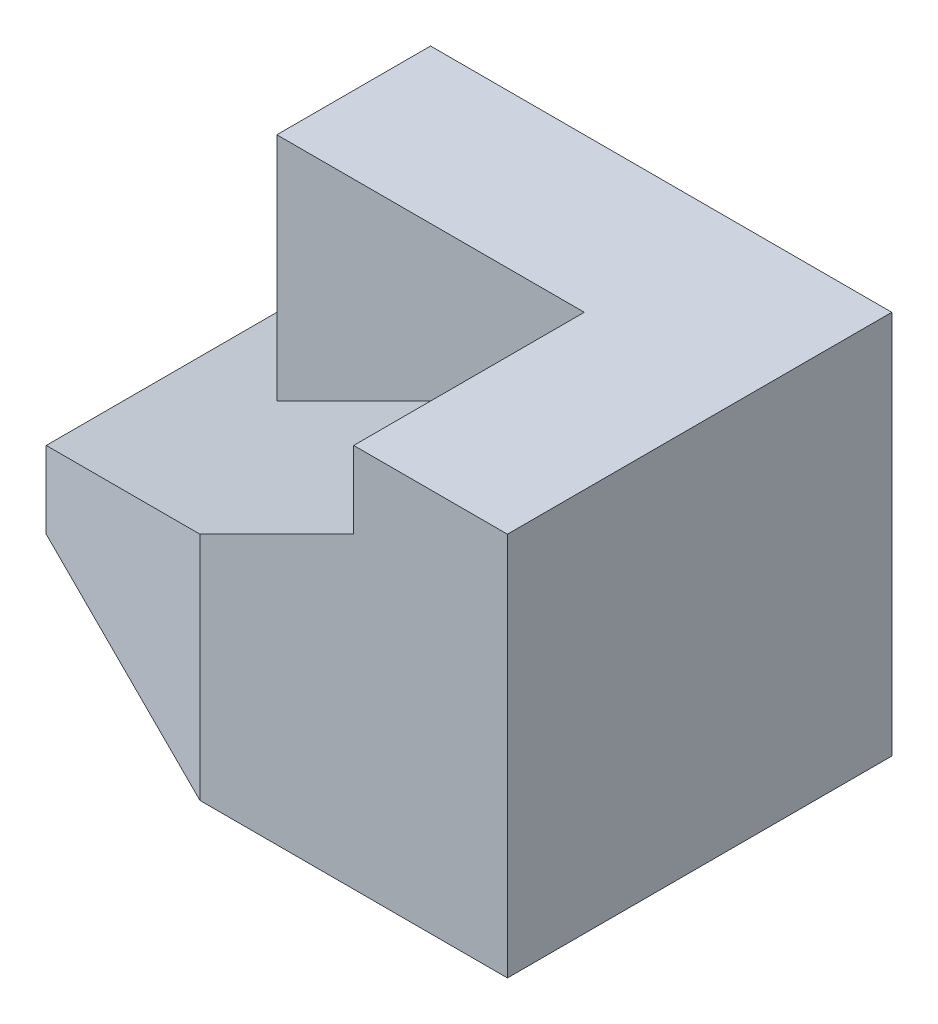
ISO-10303-21;
HEADER;
FILE_DESCRIPTION(('STEP AP214'),'2;1');
FILE_NAME('part.step','',(''),(''),'','','');
FILE_SCHEMA(('AUTOMOTIVE_DESIGN { 1 0 10303 214 1 1 1 1 }'));
ENDSEC;
DATA;
#1=APPLICATION_CONTEXT('core data for automotive mechanical design processes');
#2=APPLICATION_PROTOCOL_DEFINITION('international standard','automotive_design',2000,#1);
#3=PRODUCT_CONTEXT('',#1,'mechanical');
#4=PRODUCT('Part','Part','',(#3));
#5=PRODUCT_RELATED_PRODUCT_CATEGORY('part','',(#4));
#6=PRODUCT_DEFINITION_FORMATION('','',#4);
#7=PRODUCT_DEFINITION_CONTEXT('part definition',#1,'design');
#8=PRODUCT_DEFINITION('design','',#6,#7);
#9=PRODUCT_DEFINITION_SHAPE('','',#8);
#10=(LENGTH_UNIT() NAMED_UNIT(*) SI_UNIT(.MILLI.,.METRE.));
#11=(NAMED_UNIT(*) PLANE_ANGLE_UNIT() SI_UNIT($,.RADIAN.));
#12=(NAMED_UNIT(*) SI_UNIT($,.STERADIAN.) SOLID_ANGLE_UNIT());
#13=UNCERTAINTY_MEASURE_WITH_UNIT(LENGTH_MEASURE(1.E-05),#10,'distance_accuracy_value','');
#14=(GEOMETRIC_REPRESENTATION_CONTEXT(3) GLOBAL_UNCERTAINTY_ASSIGNED_CONTEXT((#13)) GLOBAL_UNIT_ASSIGNED_CONTEXT((#10,
#11,#12)) REPRESENTATION_CONTEXT('',''));
#15=CARTESIAN_POINT('',(0.,0.,0.));
#16=DIRECTION('',(0.,0.,1.));
#17=DIRECTION('',(1.,0.,0.));
#18=AXIS2_PLACEMENT_3D('',#15,#16,#17);
#19=CARTESIAN_POINT('',(0.,0.,-50.));
#20=DIRECTION('',(0.,0.,-1.));
#21=DIRECTION('',(-1.,0.,0.));
#22=AXIS2_PLACEMENT_3D('',#19,#20,#21);
#23=PLANE('',#22);
#24=DIRECTION('',(0.,1.,0.));
#25=VECTOR('',#24,1.);
#26=CARTESIAN_POINT('',(80.,0.,-50.));
#27=LINE('',#26,#25);
#28=CARTESIAN_POINT('',(80.,0.,-50.));
#29=VERTEX_POINT('',#28);
#30=CARTESIAN_POINT('',(80.,50.,-50.));
#31=VERTEX_POINT('',#30);
#32=EDGE_CURVE('E162',#29,#31,#27,.T.);
#33=ORIENTED_EDGE('',*,*,#32,.F.);
#34=DIRECTION('',(1.,0.,0.));
#35=VECTOR('',#34,1.);
#36=CARTESIAN_POINT('',(0.,0.,-50.));
#37=LINE('',#36,#35);
#38=CARTESIAN_POINT('',(0.,0.,-50.));
#39=VERTEX_POINT('',#38);
#40=EDGE_CURVE('E159',#39,#29,#37,.T.);
#41=ORIENTED_EDGE('',*,*,#40,.F.);
#42=DIRECTION('',(0.,-1.,0.));
#43=VECTOR('',#42,1.);
#44=CARTESIAN_POINT('',(0.,0.,-50.));
#45=LINE('',#44,#43);
#46=CARTESIAN_POINT('',(0.,10.,-50.));
#47=VERTEX_POINT('',#46);
#48=EDGE_CURVE('E157',#47,#39,#45,.T.);
#49=ORIENTED_EDGE('',*,*,#48,.F.);
#50=DIRECTION('',(-0.894427190999916,-0.447213595499958,0.));
#51=VECTOR('',#50,1.);
#52=CARTESIAN_POINT('',(-4.,8.,-50.));
#53=LINE('',#52,#51);
#54=CARTESIAN_POINT('',(20.,20.,-50.));
#55=VERTEX_POINT('',#54);
#56=EDGE_CURVE('E129',#55,#47,#53,.T.);
#57=ORIENTED_EDGE('',*,*,#56,.F.);
#58=DIRECTION('',(0.,-1.,0.));
#59=VECTOR('',#58,1.);
#60=CARTESIAN_POINT('',(20.,50.,-50.));
#61=LINE('',#60,#59);
#62=CARTESIAN_POINT('',(20.,50.,-50.));
#63=VERTEX_POINT('',#62);
#64=EDGE_CURVE('E124',#63,#55,#61,.T.);
#65=ORIENTED_EDGE('',*,*,#64,.F.);
#66=DIRECTION('',(-1.,0.,0.));
#67=VECTOR('',#66,1.);
#68=CARTESIAN_POINT('',(0.,50.,-50.));
#69=LINE('',#68,#67);
#70=EDGE_CURVE('E122',#31,#63,#69,.T.);
#71=ORIENTED_EDGE('',*,*,#70,.F.);
#72=EDGE_LOOP('',(#33,#41,#49,#57,#65,#71));
#73=FACE_BOUND('',#72,.T.);
#74=ADVANCED_FACE('F37',(#73),#23,.T.);
#75=CARTESIAN_POINT('',(20.,50.,53.));
#76=DIRECTION('',(1.,0.,0.));
#77=DIRECTION('',(0.,1.,0.));
#78=AXIS2_PLACEMENT_3D('',#75,#76,#77);
#79=PLANE('',#78);
#80=DIRECTION('',(0.,0.,-1.));
#81=VECTOR('',#80,1.);
#82=CARTESIAN_POINT('',(20.,50.,53.));
#83=LINE('',#82,#81);
#84=CARTESIAN_POINT('',(20.,50.,-30.));
#85=VERTEX_POINT('',#84);
#86=EDGE_CURVE('E59',#85,#63,#83,.T.);
#87=ORIENTED_EDGE('',*,*,#86,.T.);
#88=ORIENTED_EDGE('',*,*,#64,.T.);
#89=DIRECTION('',(0.,0.,1.));
#90=VECTOR('',#89,1.);
#91=CARTESIAN_POINT('',(20.,20.,0.));
#92=LINE('',#91,#90);
#93=CARTESIAN_POINT('',(20.,20.,-30.));
#94=VERTEX_POINT('',#93);
#95=EDGE_CURVE('E54',#55,#94,#92,.T.);
#96=ORIENTED_EDGE('',*,*,#95,.T.);
#97=DIRECTION('',(0.,1.,0.));
#98=VECTOR('',#97,1.);
#99=CARTESIAN_POINT('',(20.,13.,-30.));
#100=LINE('',#99,#98);
#101=EDGE_CURVE('E113',#94,#85,#100,.T.);
#102=ORIENTED_EDGE('',*,*,#101,.T.);
#103=EDGE_LOOP('',(#87,#88,#96,#102));
#104=FACE_BOUND('',#103,.T.);
#105=ADVANCED_FACE('F126',(#104),#79,.F.);
#106=CARTESIAN_POINT('',(0.,50.,-50.));
#107=DIRECTION('',(0.,1.,0.));
#108=DIRECTION('',(0.,0.,1.));
#109=AXIS2_PLACEMENT_3D('',#106,#107,#108);
#110=PLANE('',#109);
#111=DIRECTION('',(-1.,0.,0.));
#112=VECTOR('',#111,1.);
#113=CARTESIAN_POINT('',(0.,50.,-30.));
#114=LINE('',#113,#112);
#115=CARTESIAN_POINT('',(60.,50.,-30.));
#116=VERTEX_POINT('',#115);
#117=EDGE_CURVE('E110',#116,#85,#114,.T.);
#118=ORIENTED_EDGE('',*,*,#117,.F.);
#119=DIRECTION('',(0.,0.,1.));
#120=VECTOR('',#119,1.);
#121=CARTESIAN_POINT('',(60.,50.,-30.));
#122=LINE('',#121,#120);
#123=CARTESIAN_POINT('',(60.,50.,0.));
#124=VERTEX_POINT('',#123);
#125=EDGE_CURVE('E153',#116,#124,#122,.T.);
#126=ORIENTED_EDGE('',*,*,#125,.T.);
#127=DIRECTION('',(-1.,0.,0.));
#128=VECTOR('',#127,1.);
#129=CARTESIAN_POINT('',(0.,50.,0.));
#130=LINE('',#129,#128);
#131=CARTESIAN_POINT('',(80.,50.,0.));
#132=VERTEX_POINT('',#131);
#133=EDGE_CURVE('E160',#132,#124,#130,.T.);
#134=ORIENTED_EDGE('',*,*,#133,.F.);
#135=DIRECTION('',(0.,0.,1.));
#136=VECTOR('',#135,1.);
#137=CARTESIAN_POINT('',(80.,50.,-50.));
#138=LINE('',#137,#136);
#139=EDGE_CURVE('E11',#31,#132,#138,.T.);
#140=ORIENTED_EDGE('',*,*,#139,.F.);
#141=ORIENTED_EDGE('',*,*,#70,.T.);
#142=ORIENTED_EDGE('',*,*,#86,.F.);
#143=EDGE_LOOP('',(#118,#126,#134,#140,#141,#142));
#144=FACE_BOUND('',#143,.T.);
#145=ADVANCED_FACE('F120',(#144),#110,.T.);
#146=CARTESIAN_POINT('',(0.,0.,0.));
#147=DIRECTION('',(0.,0.,-1.));
#148=DIRECTION('',(-1.,0.,0.));
#149=AXIS2_PLACEMENT_3D('',#146,#147,#148);
#150=PLANE('',#149);
#151=DIRECTION('',(-0.894427190999916,-0.447213595499958,0.));
#152=VECTOR('',#151,1.);
#153=CARTESIAN_POINT('',(-4.,8.,0.));
#154=LINE('',#153,#152);
#155=CARTESIAN_POINT('',(60.,40.,0.));
#156=VERTEX_POINT('',#155);
#157=CARTESIAN_POINT('',(40.,30.,0.));
#158=VERTEX_POINT('',#157);
#159=EDGE_CURVE('E145',#156,#158,#154,.T.);
#160=ORIENTED_EDGE('',*,*,#159,.T.);
#161=DIRECTION('',(0.,-1.,0.));
#162=VECTOR('',#161,1.);
#163=CARTESIAN_POINT('',(40.,103.,0.));
#164=LINE('',#163,#162);
#165=CARTESIAN_POINT('',(40.,0.,0.));
#166=VERTEX_POINT('',#165);
#167=EDGE_CURVE('E140',#158,#166,#164,.T.);
#168=ORIENTED_EDGE('',*,*,#167,.T.);
#169=DIRECTION('',(1.,0.,0.));
#170=VECTOR('',#169,1.);
#171=CARTESIAN_POINT('',(0.,0.,0.));
#172=LINE('',#171,#170);
#173=CARTESIAN_POINT('',(80.,0.,0.));
#174=VERTEX_POINT('',#173);
#175=EDGE_CURVE('E155',#166,#174,#172,.T.);
#176=ORIENTED_EDGE('',*,*,#175,.T.);
#177=DIRECTION('',(0.,1.,0.));
#178=VECTOR('',#177,1.);
#179=CARTESIAN_POINT('',(80.,0.,0.));
#180=LINE('',#179,#178);
#181=EDGE_CURVE('E167',#174,#132,#180,.T.);
#182=ORIENTED_EDGE('',*,*,#181,.T.);
#183=ORIENTED_EDGE('',*,*,#133,.T.);
#184=DIRECTION('',(0.,-1.,0.));
#185=VECTOR('',#184,1.);
#186=CARTESIAN_POINT('',(60.,0.,0.));
#187=LINE('',#186,#185);
#188=EDGE_CURVE('E147',#124,#156,#187,.T.);
#189=ORIENTED_EDGE('',*,*,#188,.T.);
#190=EDGE_LOOP('',(#160,#168,#176,#182,#183,#189));
#191=FACE_BOUND('',#190,.T.);
#192=ADVANCED_FACE('F192',(#191),#150,.F.);
#193=CARTESIAN_POINT('',(0.,0.,-50.));
#194=DIRECTION('',(-1.,0.,0.));
#195=DIRECTION('',(0.,0.,1.));
#196=AXIS2_PLACEMENT_3D('',#193,#194,#195);
#197=PLANE('',#196);
#198=DIRECTION('',(0.,-1.,0.));
#199=VECTOR('',#198,1.);
#200=CARTESIAN_POINT('',(0.,103.,-20.));
#201=LINE('',#200,#199);
#202=CARTESIAN_POINT('',(0.,9.99999999999999,-20.));
#203=VERTEX_POINT('',#202);
#204=CARTESIAN_POINT('',(0.,0.,-20.));
#205=VERTEX_POINT('',#204);
#206=EDGE_CURVE('E139',#203,#205,#201,.T.);
#207=ORIENTED_EDGE('',*,*,#206,.F.);
#208=DIRECTION('',(0.,0.,-1.));
#209=VECTOR('',#208,1.);
#210=CARTESIAN_POINT('',(0.,10.,53.));
#211=LINE('',#210,#209);
#212=EDGE_CURVE('E123',#203,#47,#211,.T.);
#213=ORIENTED_EDGE('',*,*,#212,.T.);
#214=ORIENTED_EDGE('',*,*,#48,.T.);
#215=DIRECTION('',(0.,0.,1.));
#216=VECTOR('',#215,1.);
#217=CARTESIAN_POINT('',(0.,0.,-50.));
#218=LINE('',#217,#216);
#219=EDGE_CURVE('E41',#39,#205,#218,.T.);
#220=ORIENTED_EDGE('',*,*,#219,.T.);
#221=EDGE_LOOP('',(#207,#213,#214,#220));
#222=FACE_BOUND('',#221,.T.);
#223=ADVANCED_FACE('F39',(#222),#197,.T.);
#224=CARTESIAN_POINT('',(80.,0.,-50.));
#225=DIRECTION('',(1.,0.,0.));
#226=DIRECTION('',(0.,0.,-1.));
#227=AXIS2_PLACEMENT_3D('',#224,#225,#226);
#228=PLANE('',#227);
#229=ORIENTED_EDGE('',*,*,#181,.F.);
#230=DIRECTION('',(0.,0.,1.));
#231=VECTOR('',#230,1.);
#232=CARTESIAN_POINT('',(80.,0.,-50.));
#233=LINE('',#232,#231);
#234=EDGE_CURVE('E46',#29,#174,#233,.T.);
#235=ORIENTED_EDGE('',*,*,#234,.F.);
#236=ORIENTED_EDGE('',*,*,#32,.T.);
#237=ORIENTED_EDGE('',*,*,#139,.T.);
#238=EDGE_LOOP('',(#229,#235,#236,#237));
#239=FACE_BOUND('',#238,.T.);
#240=ADVANCED_FACE('F189',(#239),#228,.T.);
#241=CARTESIAN_POINT('',(0.,0.,-50.));
#242=DIRECTION('',(0.,-1.,0.));
#243=DIRECTION('',(0.,0.,-1.));
#244=AXIS2_PLACEMENT_3D('',#241,#242,#243);
#245=PLANE('',#244);
#246=ORIENTED_EDGE('',*,*,#40,.T.);
#247=ORIENTED_EDGE('',*,*,#234,.T.);
#248=ORIENTED_EDGE('',*,*,#175,.F.);
#249=DIRECTION('',(0.894427190999916,0.,0.447213595499958));
#250=VECTOR('',#249,1.);
#251=CARTESIAN_POINT('',(0.,0.,-20.));
#252=LINE('',#251,#250);
#253=EDGE_CURVE('E137',#205,#166,#252,.T.);
#254=ORIENTED_EDGE('',*,*,#253,.F.);
#255=ORIENTED_EDGE('',*,*,#219,.F.);
#256=EDGE_LOOP('',(#246,#247,#248,#254,#255));
#257=FACE_BOUND('',#256,.T.);
#258=ADVANCED_FACE('F184',(#257),#245,.T.);
#259=CARTESIAN_POINT('',(60.,0.,-30.));
#260=DIRECTION('',(-1.,0.,0.));
#261=DIRECTION('',(0.,0.,1.));
#262=AXIS2_PLACEMENT_3D('',#259,#260,#261);
#263=PLANE('',#262);
#264=ORIENTED_EDGE('',*,*,#188,.F.);
#265=ORIENTED_EDGE('',*,*,#125,.F.);
#266=DIRECTION('',(0.,-1.,0.));
#267=VECTOR('',#266,1.);
#268=CARTESIAN_POINT('',(60.,0.,-30.));
#269=LINE('',#268,#267);
#270=CARTESIAN_POINT('',(60.,40.,-30.));
#271=VERTEX_POINT('',#270);
#272=EDGE_CURVE('E114',#116,#271,#269,.T.);
#273=ORIENTED_EDGE('',*,*,#272,.T.);
#274=DIRECTION('',(0.,0.,1.));
#275=VECTOR('',#274,1.);
#276=CARTESIAN_POINT('',(60.,40.,-30.));
#277=LINE('',#276,#275);
#278=EDGE_CURVE('E117',#271,#156,#277,.T.);
#279=ORIENTED_EDGE('',*,*,#278,.T.);
#280=EDGE_LOOP('',(#264,#265,#273,#279));
#281=FACE_BOUND('',#280,.T.);
#282=ADVANCED_FACE('F194',(#281),#263,.T.);
#283=CARTESIAN_POINT('',(-4.,8.,-30.));
#284=DIRECTION('',(-0.447213595499958,0.894427190999916,0.));
#285=DIRECTION('',(-0.894427190999916,-0.447213595499958,0.));
#286=AXIS2_PLACEMENT_3D('',#283,#284,#285);
#287=PLANE('',#286);
#288=DIRECTION('',(0.894427190999916,0.447213595499958,0.));
#289=VECTOR('',#288,1.);
#290=CARTESIAN_POINT('',(-4.,8.,-30.));
#291=LINE('',#290,#289);
#292=EDGE_CURVE('E127',#94,#271,#291,.T.);
#293=ORIENTED_EDGE('',*,*,#292,.F.);
#294=ORIENTED_EDGE('',*,*,#95,.F.);
#295=ORIENTED_EDGE('',*,*,#56,.T.);
#296=ORIENTED_EDGE('',*,*,#212,.F.);
#297=DIRECTION('',(-0.816496580927726,-0.408248290463863,-0.408248290463863));
#298=VECTOR('',#297,1.);
#299=CARTESIAN_POINT('',(31.,25.5,-4.49999999999999));
#300=LINE('',#299,#298);
#301=EDGE_CURVE('E135',#158,#203,#300,.T.);
#302=ORIENTED_EDGE('',*,*,#301,.F.);
#303=ORIENTED_EDGE('',*,*,#159,.F.);
#304=ORIENTED_EDGE('',*,*,#278,.F.);
#305=EDGE_LOOP('',(#293,#294,#295,#296,#302,#303,#304));
#306=FACE_BOUND('',#305,.T.);
#307=ADVANCED_FACE('F199',(#306),#287,.T.);
#308=CARTESIAN_POINT('',(0.,0.,-30.));
#309=DIRECTION('',(0.,0.,1.));
#310=DIRECTION('',(1.,0.,0.));
#311=AXIS2_PLACEMENT_3D('',#308,#309,#310);
#312=PLANE('',#311);
#313=ORIENTED_EDGE('',*,*,#117,.T.);
#314=ORIENTED_EDGE('',*,*,#101,.F.);
#315=ORIENTED_EDGE('',*,*,#292,.T.);
#316=ORIENTED_EDGE('',*,*,#272,.F.);
#317=EDGE_LOOP('',(#313,#314,#315,#316));
#318=FACE_BOUND('',#317,.T.);
#319=ADVANCED_FACE('F111',(#318),#312,.T.);
#320=CARTESIAN_POINT('',(0.,103.,-20.));
#321=DIRECTION('',(0.447213595499958,0.,-0.894427190999916));
#322=DIRECTION('',(-0.894427190999916,0.,-0.447213595499958));
#323=AXIS2_PLACEMENT_3D('',#320,#321,#322);
#324=PLANE('',#323);
#325=ORIENTED_EDGE('',*,*,#301,.T.);
#326=ORIENTED_EDGE('',*,*,#206,.T.);
#327=ORIENTED_EDGE('',*,*,#253,.T.);
#328=ORIENTED_EDGE('',*,*,#167,.F.);
#329=EDGE_LOOP('',(#325,#326,#327,#328));
#330=FACE_BOUND('',#329,.T.);
#331=ADVANCED_FACE('F201',(#330),#324,.F.);
#332=CLOSED_SHELL('',(#74,#105,#145,#192,#223,#240,#258,#282,#307,#319,#331));
#333=MANIFOLD_SOLID_BREP('B2',#332);
#334=ADVANCED_BREP_SHAPE_REPRESENTATION('',(#18,#333),#14);
#335=SHAPE_DEFINITION_REPRESENTATION(#9,#334);
ENDSEC;
END-ISO-10303-21;
